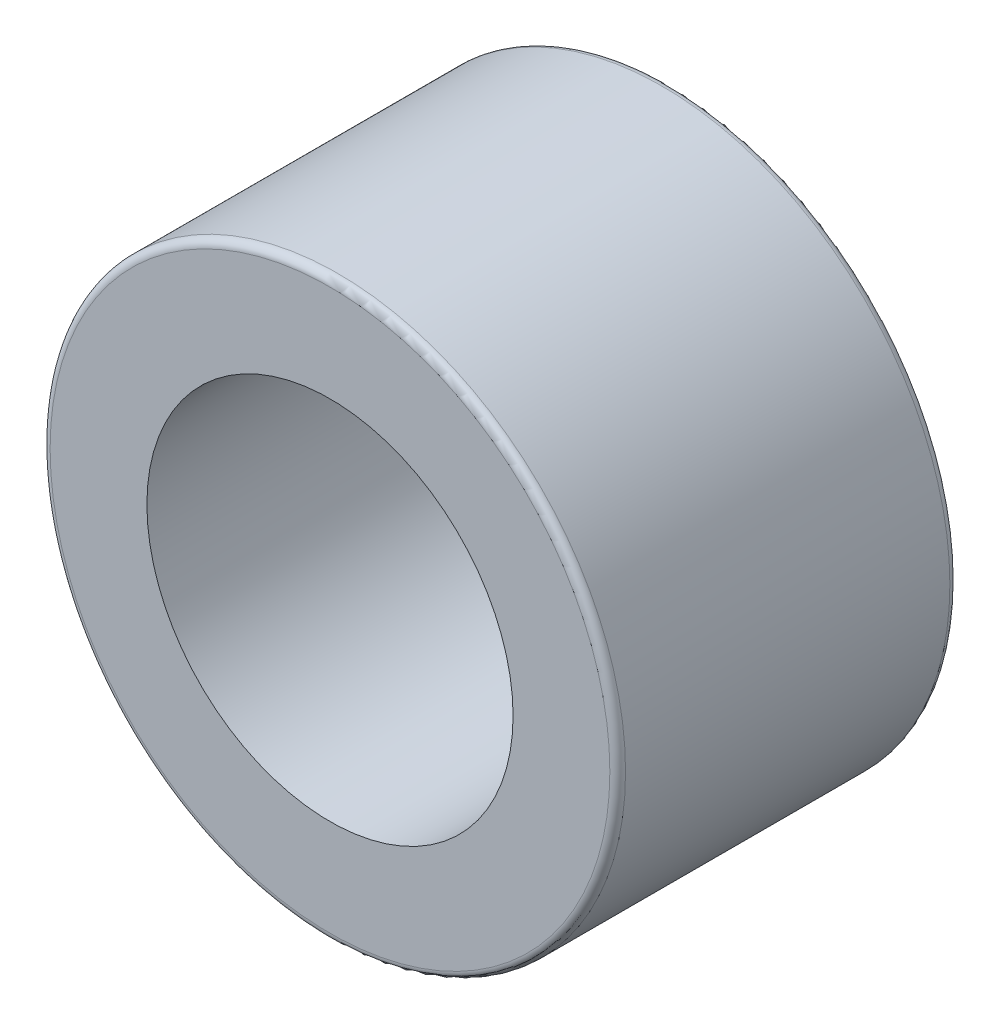
ISO-10303-21;
HEADER;
FILE_DESCRIPTION(('STEP AP214'),'2;1');
FILE_NAME('part.step','',(''),(''),'','','');
FILE_SCHEMA(('AUTOMOTIVE_DESIGN { 1 0 10303 214 1 1 1 1 }'));
ENDSEC;
DATA;
#1=APPLICATION_CONTEXT('core data for automotive mechanical design processes');
#2=APPLICATION_PROTOCOL_DEFINITION('international standard','automotive_design',2000,#1);
#3=PRODUCT_CONTEXT('',#1,'mechanical');
#4=PRODUCT('Part','Part','',(#3));
#5=PRODUCT_RELATED_PRODUCT_CATEGORY('part','',(#4));
#6=PRODUCT_DEFINITION_FORMATION('','',#4);
#7=PRODUCT_DEFINITION_CONTEXT('part definition',#1,'design');
#8=PRODUCT_DEFINITION('design','',#6,#7);
#9=PRODUCT_DEFINITION_SHAPE('','',#8);
#10=(LENGTH_UNIT() NAMED_UNIT(*) SI_UNIT(.MILLI.,.METRE.));
#11=(NAMED_UNIT(*) PLANE_ANGLE_UNIT() SI_UNIT($,.RADIAN.));
#12=(NAMED_UNIT(*) SI_UNIT($,.STERADIAN.) SOLID_ANGLE_UNIT());
#13=UNCERTAINTY_MEASURE_WITH_UNIT(LENGTH_MEASURE(1.E-05),#10,'distance_accuracy_value','');
#14=(GEOMETRIC_REPRESENTATION_CONTEXT(3) GLOBAL_UNCERTAINTY_ASSIGNED_CONTEXT((#13)) GLOBAL_UNIT_ASSIGNED_CONTEXT((#10,
#11,#12)) REPRESENTATION_CONTEXT('',''));
#15=CARTESIAN_POINT('',(0.,0.,0.));
#16=DIRECTION('',(0.,0.,1.));
#17=DIRECTION('',(1.,0.,0.));
#18=AXIS2_PLACEMENT_3D('',#15,#16,#17);
#19=CARTESIAN_POINT('',(0.,0.,13.));
#20=DIRECTION('',(0.,0.,1.));
#21=DIRECTION('',(1.,0.,0.));
#22=AXIS2_PLACEMENT_3D('',#19,#20,#21);
#23=PLANE('',#22);
#24=CARTESIAN_POINT('',(0.,0.,13.));
#25=DIRECTION('',(0.,0.,1.));
#26=DIRECTION('',(1.,0.,0.));
#27=AXIS2_PLACEMENT_3D('',#24,#25,#26);
#28=CIRCLE('',#27,10.7);
#29=CARTESIAN_POINT('',(10.7,0.,13.));
#30=VERTEX_POINT('',#29);
#31=EDGE_CURVE('E55',#30,#30,#28,.T.);
#32=ORIENTED_EDGE('',*,*,#31,.T.);
#33=EDGE_LOOP('',(#32));
#34=FACE_BOUND('',#33,.T.);
#35=CARTESIAN_POINT('',(0.,0.,13.));
#36=DIRECTION('',(0.,0.,1.));
#37=DIRECTION('',(1.,0.,0.));
#38=AXIS2_PLACEMENT_3D('',#35,#36,#37);
#39=CIRCLE('',#38,7.);
#40=CARTESIAN_POINT('',(7.,0.,13.));
#41=VERTEX_POINT('',#40);
#42=EDGE_CURVE('E61',#41,#41,#39,.T.);
#43=ORIENTED_EDGE('',*,*,#42,.F.);
#44=EDGE_LOOP('',(#43));
#45=FACE_BOUND('',#44,.T.);
#46=ADVANCED_FACE('F37',(#34,#45),#23,.T.);
#47=CARTESIAN_POINT('',(0.,0.,0.));
#48=DIRECTION('',(0.,0.,1.));
#49=DIRECTION('',(1.,0.,0.));
#50=AXIS2_PLACEMENT_3D('',#47,#48,#49);
#51=PLANE('',#50);
#52=CARTESIAN_POINT('',(0.,0.,0.));
#53=DIRECTION('',(0.,0.,1.));
#54=DIRECTION('',(1.,0.,0.));
#55=AXIS2_PLACEMENT_3D('',#52,#53,#54);
#56=CIRCLE('',#55,10.7);
#57=CARTESIAN_POINT('',(10.7,0.,0.));
#58=VERTEX_POINT('',#57);
#59=EDGE_CURVE('E10',#58,#58,#56,.F.);
#60=ORIENTED_EDGE('',*,*,#59,.T.);
#61=EDGE_LOOP('',(#60));
#62=FACE_BOUND('',#61,.T.);
#63=CARTESIAN_POINT('',(0.,0.,0.));
#64=DIRECTION('',(0.,0.,1.));
#65=DIRECTION('',(1.,0.,0.));
#66=AXIS2_PLACEMENT_3D('',#63,#64,#65);
#67=CIRCLE('',#66,7.);
#68=CARTESIAN_POINT('',(7.,0.,0.));
#69=VERTEX_POINT('',#68);
#70=EDGE_CURVE('E62',#69,#69,#67,.T.);
#71=ORIENTED_EDGE('',*,*,#70,.T.);
#72=EDGE_LOOP('',(#71));
#73=FACE_BOUND('',#72,.T.);
#74=ADVANCED_FACE('F74',(#62,#73),#51,.F.);
#75=CARTESIAN_POINT('',(0.,0.,13.));
#76=DIRECTION('',(0.,0.,-1.));
#77=DIRECTION('',(-1.,0.,0.));
#78=AXIS2_PLACEMENT_3D('',#75,#76,#77);
#79=CYLINDRICAL_SURFACE('',#78,11.);
#80=CARTESIAN_POINT('',(0.,0.,12.7));
#81=DIRECTION('',(0.,0.,1.));
#82=DIRECTION('',(1.,0.,0.));
#83=AXIS2_PLACEMENT_3D('',#80,#81,#82);
#84=CIRCLE('',#83,11.);
#85=CARTESIAN_POINT('',(11.,0.,12.7));
#86=VERTEX_POINT('',#85);
#87=EDGE_CURVE('E45',#86,#86,#84,.F.);
#88=ORIENTED_EDGE('',*,*,#87,.T.);
#89=EDGE_LOOP('',(#88));
#90=FACE_BOUND('',#89,.T.);
#91=CARTESIAN_POINT('',(0.,0.,0.3));
#92=DIRECTION('',(0.,0.,1.));
#93=DIRECTION('',(1.,0.,0.));
#94=AXIS2_PLACEMENT_3D('',#91,#92,#93);
#95=CIRCLE('',#94,11.);
#96=CARTESIAN_POINT('',(11.,0.,0.3));
#97=VERTEX_POINT('',#96);
#98=EDGE_CURVE('E50',#97,#97,#95,.T.);
#99=ORIENTED_EDGE('',*,*,#98,.T.);
#100=EDGE_LOOP('',(#99));
#101=FACE_BOUND('',#100,.T.);
#102=ADVANCED_FACE('F80',(#90,#101),#79,.T.);
#103=CARTESIAN_POINT('',(0.,0.,13.));
#104=DIRECTION('',(0.,0.,-1.));
#105=DIRECTION('',(-1.,0.,0.));
#106=AXIS2_PLACEMENT_3D('',#103,#104,#105);
#107=CYLINDRICAL_SURFACE('',#106,7.);
#108=ORIENTED_EDGE('',*,*,#42,.T.);
#109=EDGE_LOOP('',(#108));
#110=FACE_BOUND('',#109,.T.);
#111=ORIENTED_EDGE('',*,*,#70,.F.);
#112=EDGE_LOOP('',(#111));
#113=FACE_BOUND('',#112,.T.);
#114=ADVANCED_FACE('F70',(#110,#113),#107,.F.);
#115=CARTESIAN_POINT('',(0.,0.,12.7));
#116=DIRECTION('',(0.,0.,1.));
#117=DIRECTION('',(1.,0.,0.));
#118=AXIS2_PLACEMENT_3D('',#115,#116,#117);
#119=TOROIDAL_SURFACE('',#118,10.7,0.3);
#120=ORIENTED_EDGE('',*,*,#87,.F.);
#121=EDGE_LOOP('',(#120));
#122=FACE_BOUND('',#121,.T.);
#123=ORIENTED_EDGE('',*,*,#31,.F.);
#124=EDGE_LOOP('',(#123));
#125=FACE_BOUND('',#124,.T.);
#126=ADVANCED_FACE('F85',(#122,#125),#119,.T.);
#127=CARTESIAN_POINT('',(0.,0.,0.3));
#128=DIRECTION('',(0.,0.,1.));
#129=DIRECTION('',(1.,0.,0.));
#130=AXIS2_PLACEMENT_3D('',#127,#128,#129);
#131=TOROIDAL_SURFACE('',#130,10.7,0.3);
#132=ORIENTED_EDGE('',*,*,#59,.F.);
#133=EDGE_LOOP('',(#132));
#134=FACE_BOUND('',#133,.T.);
#135=ORIENTED_EDGE('',*,*,#98,.F.);
#136=EDGE_LOOP('',(#135));
#137=FACE_BOUND('',#136,.T.);
#138=ADVANCED_FACE('F39',(#134,#137),#131,.T.);
#139=CLOSED_SHELL('',(#46,#74,#102,#114,#126,#138));
#140=MANIFOLD_SOLID_BREP('B2',#139);
#141=ADVANCED_BREP_SHAPE_REPRESENTATION('',(#18,#140),#14);
#142=SHAPE_DEFINITION_REPRESENTATION(#9,#141);
ENDSEC;
END-ISO-10303-21;
